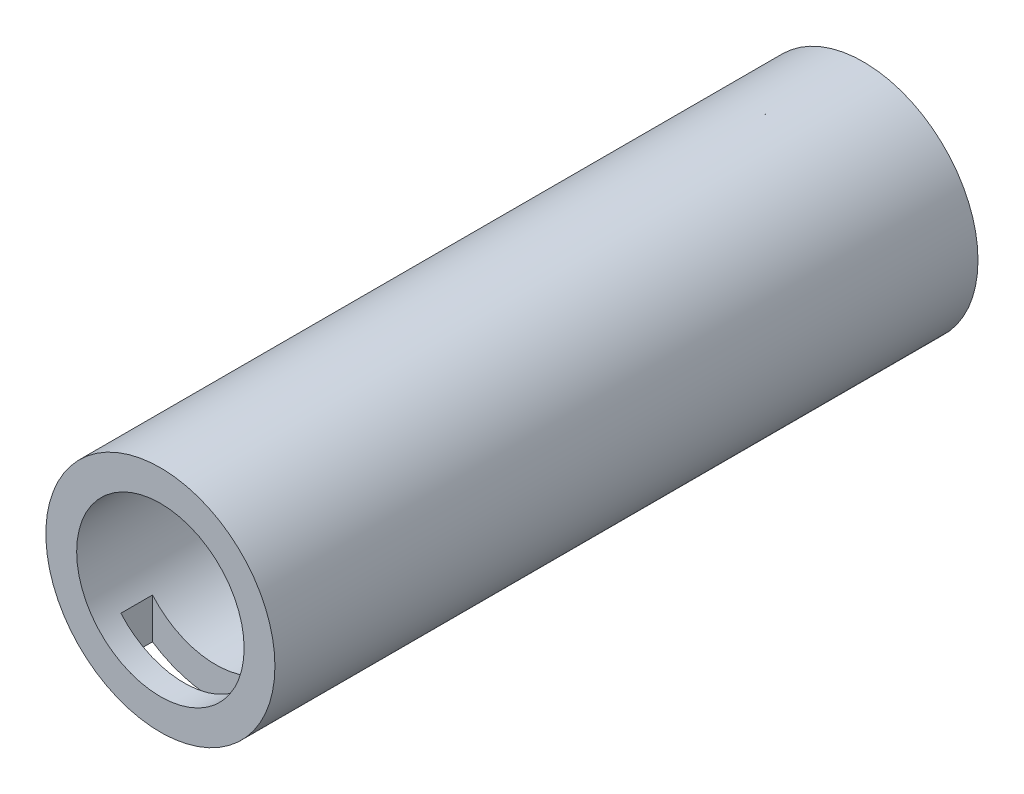
ISO-10303-21;
HEADER;
FILE_DESCRIPTION(('STEP AP214'),'2;1');
FILE_NAME('part.step','',(''),(''),'','','');
FILE_SCHEMA(('AUTOMOTIVE_DESIGN { 1 0 10303 214 1 1 1 1 }'));
ENDSEC;
DATA;
#1=APPLICATION_CONTEXT('core data for automotive mechanical design processes');
#2=APPLICATION_PROTOCOL_DEFINITION('international standard','automotive_design',2000,#1);
#3=PRODUCT_CONTEXT('',#1,'mechanical');
#4=PRODUCT('Part','Part','',(#3));
#5=PRODUCT_RELATED_PRODUCT_CATEGORY('part','',(#4));
#6=PRODUCT_DEFINITION_FORMATION('','',#4);
#7=PRODUCT_DEFINITION_CONTEXT('part definition',#1,'design');
#8=PRODUCT_DEFINITION('design','',#6,#7);
#9=PRODUCT_DEFINITION_SHAPE('','',#8);
#10=(LENGTH_UNIT() NAMED_UNIT(*) SI_UNIT(.MILLI.,.METRE.));
#11=(NAMED_UNIT(*) PLANE_ANGLE_UNIT() SI_UNIT($,.RADIAN.));
#12=(NAMED_UNIT(*) SI_UNIT($,.STERADIAN.) SOLID_ANGLE_UNIT());
#13=UNCERTAINTY_MEASURE_WITH_UNIT(LENGTH_MEASURE(1.E-05),#10,'distance_accuracy_value','');
#14=(GEOMETRIC_REPRESENTATION_CONTEXT(3) GLOBAL_UNCERTAINTY_ASSIGNED_CONTEXT((#13)) GLOBAL_UNIT_ASSIGNED_CONTEXT((#10,
#11,#12)) REPRESENTATION_CONTEXT('',''));
#15=CARTESIAN_POINT('',(0.,0.,0.));
#16=DIRECTION('',(0.,0.,1.));
#17=DIRECTION('',(1.,0.,0.));
#18=AXIS2_PLACEMENT_3D('',#15,#16,#17);
#19=CARTESIAN_POINT('',(-10.16,12.7,109.22));
#20=DIRECTION('',(1.,0.,0.));
#21=DIRECTION('',(0.,0.,-1.));
#22=AXIS2_PLACEMENT_3D('',#19,#20,#21);
#23=PLANE('',#22);
#24=DIRECTION('',(0.,0.,-1.));
#25=VECTOR('',#24,1.);
#26=CARTESIAN_POINT('',(-10.16,-8.83175203456258,151.106285953333));
#27=LINE('',#26,#25);
#28=CARTESIAN_POINT('',(-10.16,-8.83175203456256,109.22));
#29=VERTEX_POINT('',#28);
#30=CARTESIAN_POINT('',(-10.16,-8.83175203456258,104.14));
#31=VERTEX_POINT('',#30);
#32=EDGE_CURVE('E237',#29,#31,#27,.T.);
#33=ORIENTED_EDGE('',*,*,#32,.F.);
#34=DIRECTION('',(0.,-1.,0.));
#35=VECTOR('',#34,1.);
#36=CARTESIAN_POINT('',(-10.16,12.7,109.22));
#37=LINE('',#36,#35);
#38=CARTESIAN_POINT('',(-10.16,-15.3586010105087,109.22));
#39=VERTEX_POINT('',#38);
#40=EDGE_CURVE('E164',#29,#39,#37,.T.);
#41=ORIENTED_EDGE('',*,*,#40,.T.);
#42=DIRECTION('',(0.,0.,-1.));
#43=VECTOR('',#42,1.);
#44=CARTESIAN_POINT('',(-10.16,-15.3586010105087,113.03));
#45=LINE('',#44,#43);
#46=CARTESIAN_POINT('',(-10.16,-15.3586010105087,104.14));
#47=VERTEX_POINT('',#46);
#48=EDGE_CURVE('E189',#39,#47,#45,.T.);
#49=ORIENTED_EDGE('',*,*,#48,.T.);
#50=DIRECTION('',(0.,-1.,0.));
#51=VECTOR('',#50,1.);
#52=CARTESIAN_POINT('',(-10.16,12.7,104.14));
#53=LINE('',#52,#51);
#54=EDGE_CURVE('E169',#31,#47,#53,.T.);
#55=ORIENTED_EDGE('',*,*,#54,.F.);
#56=EDGE_LOOP('',(#33,#41,#49,#55));
#57=FACE_BOUND('',#56,.T.);
#58=ADVANCED_FACE('F39',(#57),#23,.T.);
#59=CARTESIAN_POINT('',(0.,0.,113.03));
#60=DIRECTION('',(0.,0.,-1.));
#61=DIRECTION('',(-1.,0.,0.));
#62=AXIS2_PLACEMENT_3D('',#59,#60,#61);
#63=CYLINDRICAL_SURFACE('',#62,18.415);
#64=CARTESIAN_POINT('',(0.,0.,0.));
#65=DIRECTION('',(0.,0.,1.));
#66=DIRECTION('',(1.,0.,0.));
#67=AXIS2_PLACEMENT_3D('',#64,#65,#66);
#68=CIRCLE('',#67,18.415);
#69=CARTESIAN_POINT('',(18.415,0.,0.));
#70=VERTEX_POINT('',#69);
#71=EDGE_CURVE('E177',#70,#70,#68,.T.);
#72=ORIENTED_EDGE('',*,*,#71,.T.);
#73=EDGE_LOOP('',(#72));
#74=FACE_BOUND('',#73,.T.);
#75=CARTESIAN_POINT('',(0.,0.,113.03));
#76=DIRECTION('',(0.,0.,1.));
#77=DIRECTION('',(1.,0.,0.));
#78=AXIS2_PLACEMENT_3D('',#75,#76,#77);
#79=CIRCLE('',#78,18.415);
#80=CARTESIAN_POINT('',(18.415,0.,113.03));
#81=VERTEX_POINT('',#80);
#82=EDGE_CURVE('E178',#81,#81,#79,.T.);
#83=ORIENTED_EDGE('',*,*,#82,.F.);
#84=EDGE_LOOP('',(#83));
#85=FACE_BOUND('',#84,.T.);
#86=DIRECTION('',(0.,0.,-1.));
#87=VECTOR('',#86,1.);
#88=CARTESIAN_POINT('',(10.16,-15.3586010105087,113.03));
#89=LINE('',#88,#87);
#90=CARTESIAN_POINT('',(10.16,-15.3586010105087,104.14));
#91=VERTEX_POINT('',#90);
#92=CARTESIAN_POINT('',(10.16,-15.3586010105087,109.22));
#93=VERTEX_POINT('',#92);
#94=EDGE_CURVE('E127',#91,#93,#89,.F.);
#95=ORIENTED_EDGE('',*,*,#94,.F.);
#96=CARTESIAN_POINT('',(0.,0.,104.14));
#97=DIRECTION('',(0.,0.,1.));
#98=DIRECTION('',(1.,0.,0.));
#99=AXIS2_PLACEMENT_3D('',#96,#97,#98);
#100=CIRCLE('',#99,18.415);
#101=EDGE_CURVE('E193',#47,#91,#100,.T.);
#102=ORIENTED_EDGE('',*,*,#101,.F.);
#103=ORIENTED_EDGE('',*,*,#48,.F.);
#104=CARTESIAN_POINT('',(0.,0.,109.22));
#105=DIRECTION('',(0.,0.,-1.));
#106=DIRECTION('',(-1.,0.,0.));
#107=AXIS2_PLACEMENT_3D('',#104,#105,#106);
#108=CIRCLE('',#107,18.415);
#109=EDGE_CURVE('E182',#93,#39,#108,.T.);
#110=ORIENTED_EDGE('',*,*,#109,.F.);
#111=EDGE_LOOP('',(#95,#102,#103,#110));
#112=FACE_BOUND('',#111,.T.);
#113=ADVANCED_FACE('F41',(#74,#85,#112),#63,.T.);
#114=CARTESIAN_POINT('',(0.,0.,113.03));
#115=DIRECTION('',(0.,0.,1.));
#116=DIRECTION('',(1.,0.,0.));
#117=AXIS2_PLACEMENT_3D('',#114,#115,#116);
#118=PLANE('',#117);
#119=CARTESIAN_POINT('',(0.,0.,113.03));
#120=DIRECTION('',(0.,0.,1.));
#121=DIRECTION('',(1.,0.,0.));
#122=AXIS2_PLACEMENT_3D('',#119,#120,#121);
#123=CIRCLE('',#122,13.462);
#124=CARTESIAN_POINT('',(13.462,0.,113.03));
#125=VERTEX_POINT('',#124);
#126=EDGE_CURVE('E246',#125,#125,#123,.F.);
#127=ORIENTED_EDGE('',*,*,#126,.T.);
#128=EDGE_LOOP('',(#127));
#129=FACE_BOUND('',#128,.T.);
#130=ORIENTED_EDGE('',*,*,#82,.T.);
#131=EDGE_LOOP('',(#130));
#132=FACE_BOUND('',#131,.T.);
#133=ADVANCED_FACE('F277',(#129,#132),#118,.T.);
#134=CARTESIAN_POINT('',(0.,0.,0.));
#135=DIRECTION('',(0.,0.,1.));
#136=DIRECTION('',(1.,0.,0.));
#137=AXIS2_PLACEMENT_3D('',#134,#135,#136);
#138=PLANE('',#137);
#139=ORIENTED_EDGE('',*,*,#71,.F.);
#140=EDGE_LOOP('',(#139));
#141=FACE_BOUND('',#140,.T.);
#142=ADVANCED_FACE('F333',(#141),#138,.F.);
#143=CARTESIAN_POINT('',(10.16,12.7,109.22));
#144=DIRECTION('',(-1.,0.,0.));
#145=DIRECTION('',(0.,0.,1.));
#146=AXIS2_PLACEMENT_3D('',#143,#144,#145);
#147=PLANE('',#146);
#148=DIRECTION('',(0.,0.,-1.));
#149=VECTOR('',#148,1.);
#150=CARTESIAN_POINT('',(10.16,-8.83175203456256,151.106285953333));
#151=LINE('',#150,#149);
#152=CARTESIAN_POINT('',(10.16,-8.83175203456256,104.14));
#153=VERTEX_POINT('',#152);
#154=CARTESIAN_POINT('',(10.16,-8.83175203456256,109.22));
#155=VERTEX_POINT('',#154);
#156=EDGE_CURVE('E55',#153,#155,#151,.F.);
#157=ORIENTED_EDGE('',*,*,#156,.F.);
#158=DIRECTION('',(0.,-1.,0.));
#159=VECTOR('',#158,1.);
#160=CARTESIAN_POINT('',(10.16,12.7,104.14));
#161=LINE('',#160,#159);
#162=EDGE_CURVE('E172',#153,#91,#161,.T.);
#163=ORIENTED_EDGE('',*,*,#162,.T.);
#164=ORIENTED_EDGE('',*,*,#94,.T.);
#165=DIRECTION('',(0.,-1.,0.));
#166=VECTOR('',#165,1.);
#167=CARTESIAN_POINT('',(10.16,12.7,109.22));
#168=LINE('',#167,#166);
#169=EDGE_CURVE('E159',#155,#93,#168,.T.);
#170=ORIENTED_EDGE('',*,*,#169,.F.);
#171=EDGE_LOOP('',(#157,#163,#164,#170));
#172=FACE_BOUND('',#171,.T.);
#173=ADVANCED_FACE('F203',(#172),#147,.T.);
#174=CARTESIAN_POINT('',(10.16,12.7,104.14));
#175=DIRECTION('',(0.,0.,1.));
#176=DIRECTION('',(1.,0.,0.));
#177=AXIS2_PLACEMENT_3D('',#174,#175,#176);
#178=PLANE('',#177);
#179=CARTESIAN_POINT('',(0.,0.,104.14));
#180=DIRECTION('',(0.,0.,1.));
#181=DIRECTION('',(1.,0.,0.));
#182=AXIS2_PLACEMENT_3D('',#179,#180,#181);
#183=CIRCLE('',#182,13.462);
#184=EDGE_CURVE('E138',#31,#153,#183,.T.);
#185=ORIENTED_EDGE('',*,*,#184,.F.);
#186=ORIENTED_EDGE('',*,*,#54,.T.);
#187=ORIENTED_EDGE('',*,*,#101,.T.);
#188=ORIENTED_EDGE('',*,*,#162,.F.);
#189=EDGE_LOOP('',(#185,#186,#187,#188));
#190=FACE_BOUND('',#189,.T.);
#191=ADVANCED_FACE('F267',(#190),#178,.T.);
#192=CARTESIAN_POINT('',(10.16,12.7,109.22));
#193=DIRECTION('',(0.,0.,-1.));
#194=DIRECTION('',(-1.,0.,0.));
#195=AXIS2_PLACEMENT_3D('',#192,#193,#194);
#196=PLANE('',#195);
#197=CARTESIAN_POINT('',(0.,0.,109.22));
#198=DIRECTION('',(0.,0.,-1.));
#199=DIRECTION('',(-1.,0.,0.));
#200=AXIS2_PLACEMENT_3D('',#197,#198,#199);
#201=CIRCLE('',#200,13.462);
#202=EDGE_CURVE('E211',#155,#29,#201,.T.);
#203=ORIENTED_EDGE('',*,*,#202,.F.);
#204=ORIENTED_EDGE('',*,*,#169,.T.);
#205=ORIENTED_EDGE('',*,*,#109,.T.);
#206=ORIENTED_EDGE('',*,*,#40,.F.);
#207=EDGE_LOOP('',(#203,#204,#205,#206));
#208=FACE_BOUND('',#207,.T.);
#209=ADVANCED_FACE('F210',(#208),#196,.T.);
#210=CARTESIAN_POINT('',(0.,0.,5.08));
#211=DIRECTION('',(0.,0.,-1.));
#212=DIRECTION('',(-1.,0.,0.));
#213=AXIS2_PLACEMENT_3D('',#210,#211,#212);
#214=PLANE('',#213);
#215=CARTESIAN_POINT('',(0.,0.,5.08));
#216=DIRECTION('',(0.,0.,-1.));
#217=DIRECTION('',(-1.,0.,0.));
#218=AXIS2_PLACEMENT_3D('',#215,#216,#217);
#219=CIRCLE('',#218,13.462);
#220=CARTESIAN_POINT('',(-13.462,0.,5.08));
#221=VERTEX_POINT('',#220);
#222=EDGE_CURVE('E250',#221,#221,#219,.T.);
#223=ORIENTED_EDGE('',*,*,#222,.F.);
#224=EDGE_LOOP('',(#223));
#225=FACE_BOUND('',#224,.T.);
#226=ADVANCED_FACE('F259',(#225),#214,.F.);
#227=CARTESIAN_POINT('',(0.,0.,151.106285953333));
#228=DIRECTION('',(0.,0.,-1.));
#229=DIRECTION('',(-1.,0.,0.));
#230=AXIS2_PLACEMENT_3D('',#227,#228,#229);
#231=CYLINDRICAL_SURFACE('',#230,13.462);
#232=ORIENTED_EDGE('',*,*,#156,.T.);
#233=ORIENTED_EDGE('',*,*,#202,.T.);
#234=ORIENTED_EDGE('',*,*,#32,.T.);
#235=ORIENTED_EDGE('',*,*,#184,.T.);
#236=EDGE_LOOP('',(#232,#233,#234,#235));
#237=FACE_BOUND('',#236,.T.);
#238=DIRECTION('',(0.,0.,-1.));
#239=VECTOR('',#238,1.);
#240=CARTESIAN_POINT('',(10.16,8.83175203456256,151.106285953333));
#241=LINE('',#240,#239);
#242=CARTESIAN_POINT('',(10.16,8.83175203456256,109.22));
#243=VERTEX_POINT('',#242);
#244=CARTESIAN_POINT('',(10.16,8.83175203456256,104.14));
#245=VERTEX_POINT('',#244);
#246=EDGE_CURVE('E226',#243,#245,#241,.T.);
#247=ORIENTED_EDGE('',*,*,#246,.T.);
#248=CARTESIAN_POINT('',(4.46491254113672,12.7,104.14));
#249=VERTEX_POINT('',#248);
#250=EDGE_CURVE('E63',#245,#249,#183,.T.);
#251=ORIENTED_EDGE('',*,*,#250,.T.);
#252=DIRECTION('',(0.,0.,-1.));
#253=VECTOR('',#252,1.);
#254=CARTESIAN_POINT('',(4.46491254113672,12.7,151.106285953333));
#255=LINE('',#254,#253);
#256=CARTESIAN_POINT('',(4.46491254113672,12.7,109.22));
#257=VERTEX_POINT('',#256);
#258=EDGE_CURVE('E11',#257,#249,#255,.T.);
#259=ORIENTED_EDGE('',*,*,#258,.F.);
#260=EDGE_CURVE('E135',#257,#243,#201,.T.);
#261=ORIENTED_EDGE('',*,*,#260,.T.);
#262=EDGE_LOOP('',(#247,#251,#259,#261));
#263=FACE_BOUND('',#262,.T.);
#264=CARTESIAN_POINT('',(-4.46491254113672,12.7,104.14));
#265=VERTEX_POINT('',#264);
#266=CARTESIAN_POINT('',(-10.16,8.83175203456258,104.14));
#267=VERTEX_POINT('',#266);
#268=EDGE_CURVE('E118',#265,#267,#183,.T.);
#269=ORIENTED_EDGE('',*,*,#268,.T.);
#270=DIRECTION('',(0.,0.,-1.));
#271=VECTOR('',#270,1.);
#272=CARTESIAN_POINT('',(-10.16,8.83175203456258,151.106285953333));
#273=LINE('',#272,#271);
#274=CARTESIAN_POINT('',(-10.16,8.83175203456256,109.22));
#275=VERTEX_POINT('',#274);
#276=EDGE_CURVE('E136',#267,#275,#273,.F.);
#277=ORIENTED_EDGE('',*,*,#276,.T.);
#278=CARTESIAN_POINT('',(-4.46491254113672,12.7,109.22));
#279=VERTEX_POINT('',#278);
#280=EDGE_CURVE('E121',#275,#279,#201,.T.);
#281=ORIENTED_EDGE('',*,*,#280,.T.);
#282=DIRECTION('',(0.,0.,-1.));
#283=VECTOR('',#282,1.);
#284=CARTESIAN_POINT('',(-4.46491254113672,12.7,151.106285953333));
#285=LINE('',#284,#283);
#286=EDGE_CURVE('E48',#265,#279,#285,.F.);
#287=ORIENTED_EDGE('',*,*,#286,.F.);
#288=EDGE_LOOP('',(#269,#277,#281,#287));
#289=FACE_BOUND('',#288,.T.);
#290=ORIENTED_EDGE('',*,*,#222,.T.);
#291=EDGE_LOOP('',(#290));
#292=FACE_BOUND('',#291,.T.);
#293=ORIENTED_EDGE('',*,*,#126,.F.);
#294=EDGE_LOOP('',(#293));
#295=FACE_BOUND('',#294,.T.);
#296=ADVANCED_FACE('F116',(#237,#263,#289,#292,#295),#231,.F.);
#297=CARTESIAN_POINT('',(0.,12.7,0.));
#298=DIRECTION('',(0.,1.,0.));
#299=DIRECTION('',(0.,0.,1.));
#300=AXIS2_PLACEMENT_3D('',#297,#298,#299);
#301=PLANE('',#300);
#302=DIRECTION('',(1.,0.,0.));
#303=VECTOR('',#302,1.);
#304=CARTESIAN_POINT('',(10.16,12.7,109.22));
#305=LINE('',#304,#303);
#306=CARTESIAN_POINT('',(10.16,12.7,109.22));
#307=VERTEX_POINT('',#306);
#308=EDGE_CURVE('E155',#257,#307,#305,.T.);
#309=ORIENTED_EDGE('',*,*,#308,.F.);
#310=ORIENTED_EDGE('',*,*,#258,.T.);
#311=DIRECTION('',(-1.,0.,0.));
#312=VECTOR('',#311,1.);
#313=CARTESIAN_POINT('',(10.16,12.7,104.14));
#314=LINE('',#313,#312);
#315=CARTESIAN_POINT('',(10.16,12.7,104.14));
#316=VERTEX_POINT('',#315);
#317=EDGE_CURVE('E143',#316,#249,#314,.T.);
#318=ORIENTED_EDGE('',*,*,#317,.F.);
#319=DIRECTION('',(0.,0.,-1.));
#320=VECTOR('',#319,1.);
#321=CARTESIAN_POINT('',(10.16,12.7,109.22));
#322=LINE('',#321,#320);
#323=EDGE_CURVE('E144',#307,#316,#322,.T.);
#324=ORIENTED_EDGE('',*,*,#323,.F.);
#325=EDGE_LOOP('',(#309,#310,#318,#324));
#326=FACE_BOUND('',#325,.T.);
#327=ADVANCED_FACE('F227',(#326),#301,.F.);
#328=ORIENTED_EDGE('',*,*,#260,.F.);
#329=ORIENTED_EDGE('',*,*,#308,.T.);
#330=EDGE_CURVE('E160',#307,#243,#168,.T.);
#331=ORIENTED_EDGE('',*,*,#330,.T.);
#332=EDGE_LOOP('',(#328,#329,#331));
#333=FACE_BOUND('',#332,.T.);
#334=ADVANCED_FACE('F219',(#333),#196,.T.);
#335=ORIENTED_EDGE('',*,*,#250,.F.);
#336=EDGE_CURVE('E173',#316,#245,#161,.T.);
#337=ORIENTED_EDGE('',*,*,#336,.F.);
#338=ORIENTED_EDGE('',*,*,#317,.T.);
#339=EDGE_LOOP('',(#335,#337,#338));
#340=FACE_BOUND('',#339,.T.);
#341=ADVANCED_FACE('F229',(#340),#178,.T.);
#342=ORIENTED_EDGE('',*,*,#246,.F.);
#343=ORIENTED_EDGE('',*,*,#330,.F.);
#344=ORIENTED_EDGE('',*,*,#323,.T.);
#345=ORIENTED_EDGE('',*,*,#336,.T.);
#346=EDGE_LOOP('',(#342,#343,#344,#345));
#347=FACE_BOUND('',#346,.T.);
#348=ADVANCED_FACE('F224',(#347),#147,.T.);
#349=CARTESIAN_POINT('',(-10.16,12.7,104.14));
#350=VERTEX_POINT('',#349);
#351=EDGE_CURVE('E131',#265,#350,#314,.T.);
#352=ORIENTED_EDGE('',*,*,#351,.F.);
#353=ORIENTED_EDGE('',*,*,#286,.T.);
#354=CARTESIAN_POINT('',(-10.16,12.7,109.22));
#355=VERTEX_POINT('',#354);
#356=EDGE_CURVE('E156',#355,#279,#305,.T.);
#357=ORIENTED_EDGE('',*,*,#356,.F.);
#358=DIRECTION('',(0.,0.,1.));
#359=VECTOR('',#358,1.);
#360=CARTESIAN_POINT('',(-10.16,12.7,109.22));
#361=LINE('',#360,#359);
#362=EDGE_CURVE('E141',#350,#355,#361,.T.);
#363=ORIENTED_EDGE('',*,*,#362,.F.);
#364=EDGE_LOOP('',(#352,#353,#357,#363));
#365=FACE_BOUND('',#364,.T.);
#366=ADVANCED_FACE('F140',(#365),#301,.F.);
#367=ORIENTED_EDGE('',*,*,#280,.F.);
#368=EDGE_CURVE('E165',#355,#275,#37,.T.);
#369=ORIENTED_EDGE('',*,*,#368,.F.);
#370=ORIENTED_EDGE('',*,*,#356,.T.);
#371=EDGE_LOOP('',(#367,#369,#370));
#372=FACE_BOUND('',#371,.T.);
#373=ADVANCED_FACE('F269',(#372),#196,.T.);
#374=ORIENTED_EDGE('',*,*,#276,.F.);
#375=EDGE_CURVE('E133',#350,#267,#53,.T.);
#376=ORIENTED_EDGE('',*,*,#375,.F.);
#377=ORIENTED_EDGE('',*,*,#362,.T.);
#378=ORIENTED_EDGE('',*,*,#368,.T.);
#379=EDGE_LOOP('',(#374,#376,#377,#378));
#380=FACE_BOUND('',#379,.T.);
#381=ADVANCED_FACE('F273',(#380),#23,.T.);
#382=ORIENTED_EDGE('',*,*,#268,.F.);
#383=ORIENTED_EDGE('',*,*,#351,.T.);
#384=ORIENTED_EDGE('',*,*,#375,.T.);
#385=EDGE_LOOP('',(#382,#383,#384));
#386=FACE_BOUND('',#385,.T.);
#387=ADVANCED_FACE('F130',(#386),#178,.T.);
#388=CLOSED_SHELL('',(#58,#113,#133,#142,#173,#191,#209,#226,#296,#327,#334,#341,#348,#366,#373,
#381,#387));
#389=MANIFOLD_SOLID_BREP('B2',#388);
#390=ADVANCED_BREP_SHAPE_REPRESENTATION('',(#18,#389),#14);
#391=SHAPE_DEFINITION_REPRESENTATION(#9,#390);
ENDSEC;
END-ISO-10303-21;
